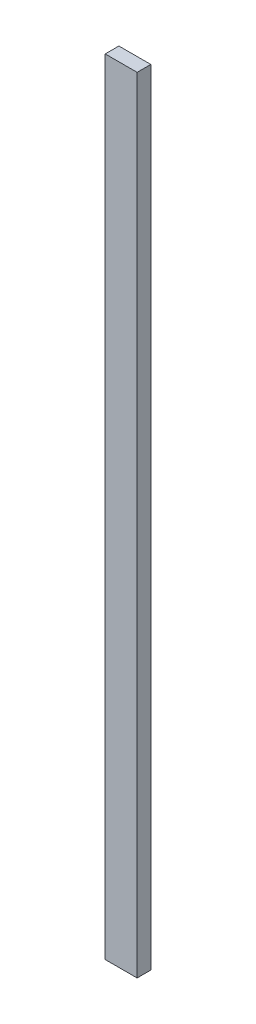
ISO-10303-21;
HEADER;
FILE_DESCRIPTION(('STEP AP214'),'2;1');
FILE_NAME('part.step','',(''),(''),'','','');
FILE_SCHEMA(('AUTOMOTIVE_DESIGN { 1 0 10303 214 1 1 1 1 }'));
ENDSEC;
DATA;
#1=APPLICATION_CONTEXT('core data for automotive mechanical design processes');
#2=APPLICATION_PROTOCOL_DEFINITION('international standard','automotive_design',2000,#1);
#3=PRODUCT_CONTEXT('',#1,'mechanical');
#4=PRODUCT('Part','Part','',(#3));
#5=PRODUCT_RELATED_PRODUCT_CATEGORY('part','',(#4));
#6=PRODUCT_DEFINITION_FORMATION('','',#4);
#7=PRODUCT_DEFINITION_CONTEXT('part definition',#1,'design');
#8=PRODUCT_DEFINITION('design','',#6,#7);
#9=PRODUCT_DEFINITION_SHAPE('','',#8);
#10=(LENGTH_UNIT() NAMED_UNIT(*) SI_UNIT(.MILLI.,.METRE.));
#11=(NAMED_UNIT(*) PLANE_ANGLE_UNIT() SI_UNIT($,.RADIAN.));
#12=(NAMED_UNIT(*) SI_UNIT($,.STERADIAN.) SOLID_ANGLE_UNIT());
#13=UNCERTAINTY_MEASURE_WITH_UNIT(LENGTH_MEASURE(1.E-05),#10,'distance_accuracy_value','');
#14=(GEOMETRIC_REPRESENTATION_CONTEXT(3) GLOBAL_UNCERTAINTY_ASSIGNED_CONTEXT((#13)) GLOBAL_UNIT_ASSIGNED_CONTEXT((#10,
#11,#12)) REPRESENTATION_CONTEXT('',''));
#15=CARTESIAN_POINT('',(0.,0.,0.));
#16=DIRECTION('',(0.,0.,1.));
#17=DIRECTION('',(1.,0.,0.));
#18=AXIS2_PLACEMENT_3D('',#15,#16,#17);
#19=CARTESIAN_POINT('',(44.45,2184.4,19.05));
#20=DIRECTION('',(-1.,0.,0.));
#21=DIRECTION('',(0.,0.,1.));
#22=AXIS2_PLACEMENT_3D('',#19,#20,#21);
#23=PLANE('',#22);
#24=DIRECTION('',(0.,0.,-1.));
#25=VECTOR('',#24,1.);
#26=CARTESIAN_POINT('',(44.45,0.,19.05));
#27=LINE('',#26,#25);
#28=CARTESIAN_POINT('',(44.45,0.,19.05));
#29=VERTEX_POINT('',#28);
#30=CARTESIAN_POINT('',(44.45,0.,-19.05));
#31=VERTEX_POINT('',#30);
#32=EDGE_CURVE('E96',#29,#31,#27,.T.);
#33=ORIENTED_EDGE('',*,*,#32,.T.);
#34=DIRECTION('',(0.,-1.,0.));
#35=VECTOR('',#34,1.);
#36=CARTESIAN_POINT('',(44.45,2184.4,-19.05));
#37=LINE('',#36,#35);
#38=CARTESIAN_POINT('',(44.45,2184.4,-19.05));
#39=VERTEX_POINT('',#38);
#40=EDGE_CURVE('E11',#39,#31,#37,.T.);
#41=ORIENTED_EDGE('',*,*,#40,.F.);
#42=DIRECTION('',(0.,0.,-1.));
#43=VECTOR('',#42,1.);
#44=CARTESIAN_POINT('',(44.45,2184.4,19.05));
#45=LINE('',#44,#43);
#46=CARTESIAN_POINT('',(44.45,2184.4,19.05));
#47=VERTEX_POINT('',#46);
#48=EDGE_CURVE('E84',#47,#39,#45,.T.);
#49=ORIENTED_EDGE('',*,*,#48,.F.);
#50=DIRECTION('',(0.,-1.,0.));
#51=VECTOR('',#50,1.);
#52=CARTESIAN_POINT('',(44.45,2184.4,19.05));
#53=LINE('',#52,#51);
#54=EDGE_CURVE('E92',#47,#29,#53,.T.);
#55=ORIENTED_EDGE('',*,*,#54,.T.);
#56=EDGE_LOOP('',(#33,#41,#49,#55));
#57=FACE_BOUND('',#56,.T.);
#58=ADVANCED_FACE('F33',(#57),#23,.F.);
#59=CARTESIAN_POINT('',(-44.45,2184.4,-19.05));
#60=DIRECTION('',(0.,0.,1.));
#61=DIRECTION('',(1.,0.,0.));
#62=AXIS2_PLACEMENT_3D('',#59,#60,#61);
#63=PLANE('',#62);
#64=DIRECTION('',(-1.,0.,0.));
#65=VECTOR('',#64,1.);
#66=CARTESIAN_POINT('',(-44.45,0.,-19.05));
#67=LINE('',#66,#65);
#68=CARTESIAN_POINT('',(-44.45,0.,-19.05));
#69=VERTEX_POINT('',#68);
#70=EDGE_CURVE('E88',#31,#69,#67,.T.);
#71=ORIENTED_EDGE('',*,*,#70,.T.);
#72=DIRECTION('',(0.,-1.,0.));
#73=VECTOR('',#72,1.);
#74=CARTESIAN_POINT('',(-44.45,2184.4,-19.05));
#75=LINE('',#74,#73);
#76=CARTESIAN_POINT('',(-44.45,2184.4,-19.05));
#77=VERTEX_POINT('',#76);
#78=EDGE_CURVE('E41',#77,#69,#75,.T.);
#79=ORIENTED_EDGE('',*,*,#78,.F.);
#80=DIRECTION('',(-1.,0.,0.));
#81=VECTOR('',#80,1.);
#82=CARTESIAN_POINT('',(-44.45,2184.4,-19.05));
#83=LINE('',#82,#81);
#84=EDGE_CURVE('E79',#39,#77,#83,.T.);
#85=ORIENTED_EDGE('',*,*,#84,.F.);
#86=ORIENTED_EDGE('',*,*,#40,.T.);
#87=EDGE_LOOP('',(#71,#79,#85,#86));
#88=FACE_BOUND('',#87,.T.);
#89=ADVANCED_FACE('F87',(#88),#63,.F.);
#90=CARTESIAN_POINT('',(-44.45,2184.4,19.05));
#91=DIRECTION('',(1.,0.,0.));
#92=DIRECTION('',(0.,0.,-1.));
#93=AXIS2_PLACEMENT_3D('',#90,#91,#92);
#94=PLANE('',#93);
#95=DIRECTION('',(0.,0.,1.));
#96=VECTOR('',#95,1.);
#97=CARTESIAN_POINT('',(-44.45,0.,19.05));
#98=LINE('',#97,#96);
#99=CARTESIAN_POINT('',(-44.45,0.,19.05));
#100=VERTEX_POINT('',#99);
#101=EDGE_CURVE('E66',#69,#100,#98,.T.);
#102=ORIENTED_EDGE('',*,*,#101,.T.);
#103=DIRECTION('',(0.,-1.,0.));
#104=VECTOR('',#103,1.);
#105=CARTESIAN_POINT('',(-44.45,2184.4,19.05));
#106=LINE('',#105,#104);
#107=CARTESIAN_POINT('',(-44.45,2184.4,19.05));
#108=VERTEX_POINT('',#107);
#109=EDGE_CURVE('E89',#108,#100,#106,.T.);
#110=ORIENTED_EDGE('',*,*,#109,.F.);
#111=DIRECTION('',(0.,0.,1.));
#112=VECTOR('',#111,1.);
#113=CARTESIAN_POINT('',(-44.45,2184.4,19.05));
#114=LINE('',#113,#112);
#115=EDGE_CURVE('E82',#77,#108,#114,.T.);
#116=ORIENTED_EDGE('',*,*,#115,.F.);
#117=ORIENTED_EDGE('',*,*,#78,.T.);
#118=EDGE_LOOP('',(#102,#110,#116,#117));
#119=FACE_BOUND('',#118,.T.);
#120=ADVANCED_FACE('F90',(#119),#94,.F.);
#121=CARTESIAN_POINT('',(-44.45,2184.4,19.05));
#122=DIRECTION('',(0.,0.,-1.));
#123=DIRECTION('',(-1.,0.,0.));
#124=AXIS2_PLACEMENT_3D('',#121,#122,#123);
#125=PLANE('',#124);
#126=DIRECTION('',(1.,0.,0.));
#127=VECTOR('',#126,1.);
#128=CARTESIAN_POINT('',(-44.45,0.,19.05));
#129=LINE('',#128,#127);
#130=EDGE_CURVE('E72',#100,#29,#129,.T.);
#131=ORIENTED_EDGE('',*,*,#130,.T.);
#132=ORIENTED_EDGE('',*,*,#54,.F.);
#133=DIRECTION('',(1.,0.,0.));
#134=VECTOR('',#133,1.);
#135=CARTESIAN_POINT('',(-44.45,2184.4,19.05));
#136=LINE('',#135,#134);
#137=EDGE_CURVE('E49',#108,#47,#136,.T.);
#138=ORIENTED_EDGE('',*,*,#137,.F.);
#139=ORIENTED_EDGE('',*,*,#109,.T.);
#140=EDGE_LOOP('',(#131,#132,#138,#139));
#141=FACE_BOUND('',#140,.T.);
#142=ADVANCED_FACE('F103',(#141),#125,.F.);
#143=CARTESIAN_POINT('',(0.,2184.4,0.));
#144=DIRECTION('',(0.,-1.,0.));
#145=DIRECTION('',(0.,0.,-1.));
#146=AXIS2_PLACEMENT_3D('',#143,#144,#145);
#147=PLANE('',#146);
#148=ORIENTED_EDGE('',*,*,#48,.T.);
#149=ORIENTED_EDGE('',*,*,#84,.T.);
#150=ORIENTED_EDGE('',*,*,#115,.T.);
#151=ORIENTED_EDGE('',*,*,#137,.T.);
#152=EDGE_LOOP('',(#148,#149,#150,#151));
#153=FACE_BOUND('',#152,.T.);
#154=ADVANCED_FACE('F80',(#153),#147,.F.);
#155=CARTESIAN_POINT('',(0.,0.,0.));
#156=DIRECTION('',(0.,-1.,0.));
#157=DIRECTION('',(0.,0.,-1.));
#158=AXIS2_PLACEMENT_3D('',#155,#156,#157);
#159=PLANE('',#158);
#160=ORIENTED_EDGE('',*,*,#32,.F.);
#161=ORIENTED_EDGE('',*,*,#130,.F.);
#162=ORIENTED_EDGE('',*,*,#101,.F.);
#163=ORIENTED_EDGE('',*,*,#70,.F.);
#164=EDGE_LOOP('',(#160,#161,#162,#163));
#165=FACE_BOUND('',#164,.T.);
#166=ADVANCED_FACE('F106',(#165),#159,.T.);
#167=CLOSED_SHELL('',(#58,#89,#120,#142,#154,#166));
#168=MANIFOLD_SOLID_BREP('B2',#167);
#169=ADVANCED_BREP_SHAPE_REPRESENTATION('',(#18,#168),#14);
#170=SHAPE_DEFINITION_REPRESENTATION(#9,#169);
ENDSEC;
END-ISO-10303-21;
